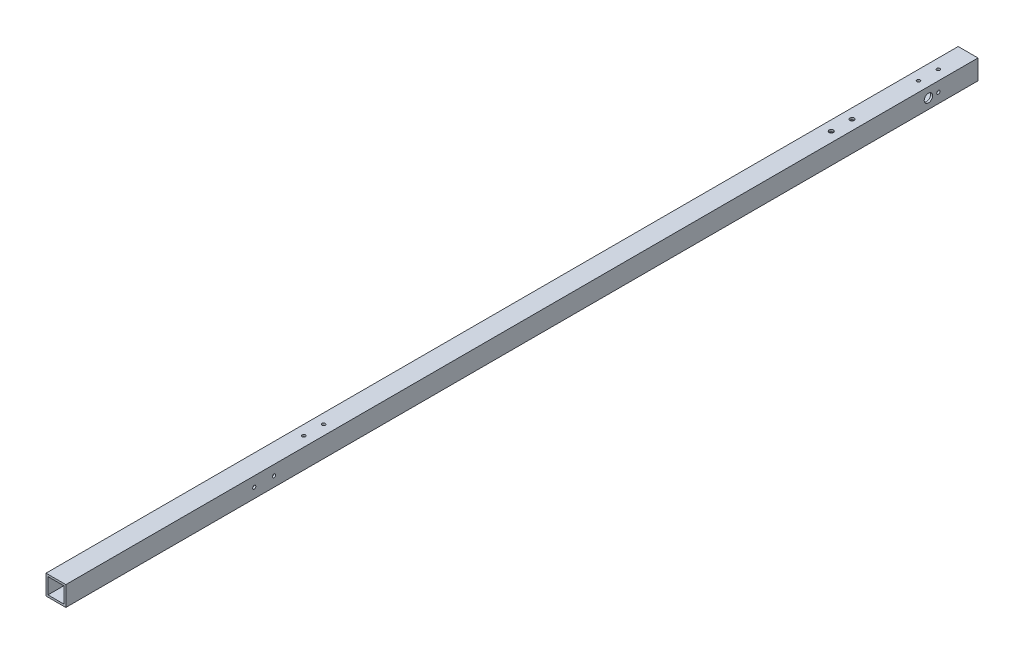
ISO-10303-21;
HEADER;
FILE_DESCRIPTION(('STEP AP214'),'2;1');
FILE_NAME('part.step','',(''),(''),'','','');
FILE_SCHEMA(('AUTOMOTIVE_DESIGN { 1 0 10303 214 1 1 1 1 }'));
ENDSEC;
DATA;
#1=APPLICATION_CONTEXT('core data for automotive mechanical design processes');
#2=APPLICATION_PROTOCOL_DEFINITION('international standard','automotive_design',2000,#1);
#3=PRODUCT_CONTEXT('',#1,'mechanical');
#4=PRODUCT('Part','Part','',(#3));
#5=PRODUCT_RELATED_PRODUCT_CATEGORY('part','',(#4));
#6=PRODUCT_DEFINITION_FORMATION('','',#4);
#7=PRODUCT_DEFINITION_CONTEXT('part definition',#1,'design');
#8=PRODUCT_DEFINITION('design','',#6,#7);
#9=PRODUCT_DEFINITION_SHAPE('','',#8);
#10=(LENGTH_UNIT() NAMED_UNIT(*) SI_UNIT(.MILLI.,.METRE.));
#11=(NAMED_UNIT(*) PLANE_ANGLE_UNIT() SI_UNIT($,.RADIAN.));
#12=(NAMED_UNIT(*) SI_UNIT($,.STERADIAN.) SOLID_ANGLE_UNIT());
#13=UNCERTAINTY_MEASURE_WITH_UNIT(LENGTH_MEASURE(1.E-05),#10,'distance_accuracy_value','');
#14=(GEOMETRIC_REPRESENTATION_CONTEXT(3) GLOBAL_UNCERTAINTY_ASSIGNED_CONTEXT((#13)) GLOBAL_UNIT_ASSIGNED_CONTEXT((#10,
#11,#12)) REPRESENTATION_CONTEXT('',''));
#15=CARTESIAN_POINT('',(0.,0.,0.));
#16=DIRECTION('',(0.,0.,1.));
#17=DIRECTION('',(1.,0.,0.));
#18=AXIS2_PLACEMENT_3D('',#15,#16,#17);
#19=CARTESIAN_POINT('',(10.,10.,970.));
#20=DIRECTION('',(-1.,0.,0.));
#21=DIRECTION('',(0.,0.,1.));
#22=AXIS2_PLACEMENT_3D('',#19,#20,#21);
#23=PLANE('',#22);
#24=CARTESIAN_POINT('',(10.,0.,39.9999999999999));
#25=DIRECTION('',(1.,0.,0.));
#26=DIRECTION('',(0.,0.,-1.));
#27=AXIS2_PLACEMENT_3D('',#24,#25,#26);
#28=CIRCLE('',#27,1.64999999999999);
#29=CARTESIAN_POINT('',(10.,0.,38.3499999999999));
#30=VERTEX_POINT('',#29);
#31=EDGE_CURVE('E245',#30,#30,#28,.T.);
#32=ORIENTED_EDGE('',*,*,#31,.F.);
#33=EDGE_LOOP('',(#32));
#34=FACE_BOUND('',#33,.T.);
#35=CARTESIAN_POINT('',(10.,0.,710.));
#36=DIRECTION('',(1.,0.,0.));
#37=DIRECTION('',(0.,0.,-1.));
#38=AXIS2_PLACEMENT_3D('',#35,#36,#37);
#39=CIRCLE('',#38,1.64999999999999);
#40=CARTESIAN_POINT('',(10.,0.,708.35));
#41=VERTEX_POINT('',#40);
#42=EDGE_CURVE('E249',#41,#41,#39,.T.);
#43=ORIENTED_EDGE('',*,*,#42,.F.);
#44=EDGE_LOOP('',(#43));
#45=FACE_BOUND('',#44,.T.);
#46=DIRECTION('',(0.,1.,0.));
#47=VECTOR('',#46,1.);
#48=CARTESIAN_POINT('',(10.,10.,920.));
#49=LINE('',#48,#47);
#50=CARTESIAN_POINT('',(10.,-10.,920.));
#51=VERTEX_POINT('',#50);
#52=CARTESIAN_POINT('',(10.,10.,920.));
#53=VERTEX_POINT('',#52);
#54=EDGE_CURVE('E186',#51,#53,#49,.T.);
#55=ORIENTED_EDGE('',*,*,#54,.F.);
#56=DIRECTION('',(0.,0.,-1.));
#57=VECTOR('',#56,1.);
#58=CARTESIAN_POINT('',(10.,-10.,970.));
#59=LINE('',#58,#57);
#60=CARTESIAN_POINT('',(10.,-10.,0.));
#61=VERTEX_POINT('',#60);
#62=EDGE_CURVE('E138',#51,#61,#59,.T.);
#63=ORIENTED_EDGE('',*,*,#62,.T.);
#64=DIRECTION('',(0.,1.,0.));
#65=VECTOR('',#64,1.);
#66=CARTESIAN_POINT('',(10.,10.,0.));
#67=LINE('',#66,#65);
#68=CARTESIAN_POINT('',(10.,10.,0.));
#69=VERTEX_POINT('',#68);
#70=EDGE_CURVE('E126',#61,#69,#67,.T.);
#71=ORIENTED_EDGE('',*,*,#70,.T.);
#72=DIRECTION('',(0.,0.,-1.));
#73=VECTOR('',#72,1.);
#74=CARTESIAN_POINT('',(10.,10.,970.));
#75=LINE('',#74,#73);
#76=EDGE_CURVE('E43',#53,#69,#75,.T.);
#77=ORIENTED_EDGE('',*,*,#76,.F.);
#78=EDGE_LOOP('',(#55,#63,#71,#77));
#79=FACE_BOUND('',#78,.T.);
#80=CARTESIAN_POINT('',(10.,0.,49.9999999999999));
#81=DIRECTION('',(1.,0.,0.));
#82=DIRECTION('',(0.,0.,-1.));
#83=AXIS2_PLACEMENT_3D('',#80,#81,#82);
#84=CIRCLE('',#83,4.25000000000001);
#85=CARTESIAN_POINT('',(10.,0.,45.7499999999999));
#86=VERTEX_POINT('',#85);
#87=EDGE_CURVE('E149',#86,#86,#84,.T.);
#88=ORIENTED_EDGE('',*,*,#87,.F.);
#89=EDGE_LOOP('',(#88));
#90=FACE_BOUND('',#89,.T.);
#91=CARTESIAN_POINT('',(10.,0.,730.));
#92=DIRECTION('',(1.,0.,0.));
#93=DIRECTION('',(0.,0.,-1.));
#94=AXIS2_PLACEMENT_3D('',#91,#92,#93);
#95=CIRCLE('',#94,1.64999999999999);
#96=CARTESIAN_POINT('',(10.,0.,728.35));
#97=VERTEX_POINT('',#96);
#98=EDGE_CURVE('E258',#97,#97,#95,.T.);
#99=ORIENTED_EDGE('',*,*,#98,.F.);
#100=EDGE_LOOP('',(#99));
#101=FACE_BOUND('',#100,.T.);
#102=ADVANCED_FACE('F35',(#34,#45,#79,#90,#101),#23,.F.);
#103=CARTESIAN_POINT('',(-10.,10.,970.));
#104=DIRECTION('',(0.,-1.,0.));
#105=DIRECTION('',(1.,0.,0.));
#106=AXIS2_PLACEMENT_3D('',#103,#104,#105);
#107=PLANE('',#106);
#108=CARTESIAN_POINT('',(0.,10.,650.));
#109=DIRECTION('',(0.,1.,0.));
#110=DIRECTION('',(0.,0.,1.));
#111=AXIS2_PLACEMENT_3D('',#108,#109,#110);
#112=CIRCLE('',#111,1.64999999999999);
#113=CARTESIAN_POINT('',(0.,10.,651.65));
#114=VERTEX_POINT('',#113);
#115=EDGE_CURVE('E164',#114,#114,#112,.T.);
#116=ORIENTED_EDGE('',*,*,#115,.F.);
#117=EDGE_LOOP('',(#116));
#118=FACE_BOUND('',#117,.T.);
#119=DIRECTION('',(-1.,0.,0.));
#120=VECTOR('',#119,1.);
#121=CARTESIAN_POINT('',(-10.,10.,920.));
#122=LINE('',#121,#120);
#123=CARTESIAN_POINT('',(-10.,10.,920.));
#124=VERTEX_POINT('',#123);
#125=EDGE_CURVE('E184',#53,#124,#122,.T.);
#126=ORIENTED_EDGE('',*,*,#125,.F.);
#127=ORIENTED_EDGE('',*,*,#76,.T.);
#128=DIRECTION('',(-1.,0.,0.));
#129=VECTOR('',#128,1.);
#130=CARTESIAN_POINT('',(-10.,10.,0.));
#131=LINE('',#130,#129);
#132=CARTESIAN_POINT('',(-10.,10.,0.));
#133=VERTEX_POINT('',#132);
#134=EDGE_CURVE('E129',#69,#133,#131,.T.);
#135=ORIENTED_EDGE('',*,*,#134,.T.);
#136=DIRECTION('',(0.,0.,-1.));
#137=VECTOR('',#136,1.);
#138=CARTESIAN_POINT('',(-10.,10.,970.));
#139=LINE('',#138,#137);
#140=EDGE_CURVE('E142',#124,#133,#139,.T.);
#141=ORIENTED_EDGE('',*,*,#140,.F.);
#142=EDGE_LOOP('',(#126,#127,#135,#141));
#143=FACE_BOUND('',#142,.T.);
#144=CARTESIAN_POINT('',(0.,10.,117.));
#145=DIRECTION('',(0.,1.,0.));
#146=DIRECTION('',(-1.,0.,0.));
#147=AXIS2_PLACEMENT_3D('',#144,#145,#146);
#148=CIRCLE('',#147,2.19999999999999);
#149=CARTESIAN_POINT('',(-2.19999999999999,10.,117.));
#150=VERTEX_POINT('',#149);
#151=EDGE_CURVE('E154',#150,#150,#148,.T.);
#152=ORIENTED_EDGE('',*,*,#151,.F.);
#153=EDGE_LOOP('',(#152));
#154=FACE_BOUND('',#153,.T.);
#155=CARTESIAN_POINT('',(0.,10.,138.));
#156=DIRECTION('',(0.,1.,0.));
#157=DIRECTION('',(-1.,0.,0.));
#158=AXIS2_PLACEMENT_3D('',#155,#156,#157);
#159=CIRCLE('',#158,2.20000000000001);
#160=CARTESIAN_POINT('',(-2.20000000000001,10.,138.));
#161=VERTEX_POINT('',#160);
#162=EDGE_CURVE('E188',#161,#161,#159,.T.);
#163=ORIENTED_EDGE('',*,*,#162,.F.);
#164=EDGE_LOOP('',(#163));
#165=FACE_BOUND('',#164,.T.);
#166=CARTESIAN_POINT('',(0.,10.,670.));
#167=DIRECTION('',(0.,1.,0.));
#168=DIRECTION('',(0.,0.,1.));
#169=AXIS2_PLACEMENT_3D('',#166,#167,#168);
#170=CIRCLE('',#169,1.64999999999999);
#171=CARTESIAN_POINT('',(0.,10.,671.65));
#172=VERTEX_POINT('',#171);
#173=EDGE_CURVE('E161',#172,#172,#170,.T.);
#174=ORIENTED_EDGE('',*,*,#173,.F.);
#175=EDGE_LOOP('',(#174));
#176=FACE_BOUND('',#175,.T.);
#177=CARTESIAN_POINT('',(0.,10.,50.));
#178=DIRECTION('',(0.,1.,0.));
#179=DIRECTION('',(0.,0.,1.));
#180=AXIS2_PLACEMENT_3D('',#177,#178,#179);
#181=CIRCLE('',#180,1.64999999999999);
#182=CARTESIAN_POINT('',(0.,10.,51.65));
#183=VERTEX_POINT('',#182);
#184=EDGE_CURVE('E175',#183,#183,#181,.T.);
#185=ORIENTED_EDGE('',*,*,#184,.F.);
#186=EDGE_LOOP('',(#185));
#187=FACE_BOUND('',#186,.T.);
#188=CARTESIAN_POINT('',(0.,10.,30.));
#189=DIRECTION('',(0.,1.,0.));
#190=DIRECTION('',(0.,0.,1.));
#191=AXIS2_PLACEMENT_3D('',#188,#189,#190);
#192=CIRCLE('',#191,1.64999999999999);
#193=CARTESIAN_POINT('',(0.,10.,31.65));
#194=VERTEX_POINT('',#193);
#195=EDGE_CURVE('E272',#194,#194,#192,.T.);
#196=ORIENTED_EDGE('',*,*,#195,.F.);
#197=EDGE_LOOP('',(#196));
#198=FACE_BOUND('',#197,.T.);
#199=ADVANCED_FACE('F236',(#118,#143,#154,#165,#176,#187,#198),#107,.F.);
#200=CARTESIAN_POINT('',(-10.,10.,970.));
#201=DIRECTION('',(1.,0.,0.));
#202=DIRECTION('',(0.,0.,-1.));
#203=AXIS2_PLACEMENT_3D('',#200,#201,#202);
#204=PLANE('',#203);
#205=CARTESIAN_POINT('',(-10.,0.,49.9999999999999));
#206=DIRECTION('',(1.,0.,0.));
#207=DIRECTION('',(0.,0.,-1.));
#208=AXIS2_PLACEMENT_3D('',#205,#206,#207);
#209=CIRCLE('',#208,4.25000000000001);
#210=CARTESIAN_POINT('',(-10.,0.,45.7499999999999));
#211=VERTEX_POINT('',#210);
#212=EDGE_CURVE('E264',#211,#211,#209,.T.);
#213=ORIENTED_EDGE('',*,*,#212,.T.);
#214=EDGE_LOOP('',(#213));
#215=FACE_BOUND('',#214,.T.);
#216=DIRECTION('',(0.,-1.,0.));
#217=VECTOR('',#216,1.);
#218=CARTESIAN_POINT('',(-10.,10.,920.));
#219=LINE('',#218,#217);
#220=CARTESIAN_POINT('',(-10.,-10.,920.));
#221=VERTEX_POINT('',#220);
#222=EDGE_CURVE('E51',#124,#221,#219,.T.);
#223=ORIENTED_EDGE('',*,*,#222,.F.);
#224=ORIENTED_EDGE('',*,*,#140,.T.);
#225=DIRECTION('',(0.,-1.,0.));
#226=VECTOR('',#225,1.);
#227=CARTESIAN_POINT('',(-10.,10.,0.));
#228=LINE('',#227,#226);
#229=CARTESIAN_POINT('',(-10.,-10.,0.));
#230=VERTEX_POINT('',#229);
#231=EDGE_CURVE('E132',#133,#230,#228,.T.);
#232=ORIENTED_EDGE('',*,*,#231,.T.);
#233=DIRECTION('',(0.,0.,-1.));
#234=VECTOR('',#233,1.);
#235=CARTESIAN_POINT('',(-10.,-10.,970.));
#236=LINE('',#235,#234);
#237=EDGE_CURVE('E140',#221,#230,#236,.T.);
#238=ORIENTED_EDGE('',*,*,#237,.F.);
#239=EDGE_LOOP('',(#223,#224,#232,#238));
#240=FACE_BOUND('',#239,.T.);
#241=ADVANCED_FACE('F229',(#215,#240),#204,.F.);
#242=CARTESIAN_POINT('',(-10.,-10.,970.));
#243=DIRECTION('',(0.,1.,0.));
#244=DIRECTION('',(0.,0.,1.));
#245=AXIS2_PLACEMENT_3D('',#242,#243,#244);
#246=PLANE('',#245);
#247=CARTESIAN_POINT('',(0.,-10.,138.));
#248=DIRECTION('',(0.,1.,0.));
#249=DIRECTION('',(0.,0.,1.));
#250=AXIS2_PLACEMENT_3D('',#247,#248,#249);
#251=CIRCLE('',#250,2.20000000000001);
#252=CARTESIAN_POINT('',(0.,-10.,140.2));
#253=VERTEX_POINT('',#252);
#254=EDGE_CURVE('E158',#253,#253,#251,.T.);
#255=ORIENTED_EDGE('',*,*,#254,.T.);
#256=EDGE_LOOP('',(#255));
#257=FACE_BOUND('',#256,.T.);
#258=CARTESIAN_POINT('',(0.,-10.,117.));
#259=DIRECTION('',(0.,1.,0.));
#260=DIRECTION('',(0.,0.,1.));
#261=AXIS2_PLACEMENT_3D('',#258,#259,#260);
#262=CIRCLE('',#261,2.19999999999999);
#263=CARTESIAN_POINT('',(0.,-10.,119.2));
#264=VERTEX_POINT('',#263);
#265=EDGE_CURVE('E199',#264,#264,#262,.T.);
#266=ORIENTED_EDGE('',*,*,#265,.T.);
#267=EDGE_LOOP('',(#266));
#268=FACE_BOUND('',#267,.T.);
#269=DIRECTION('',(1.,0.,0.));
#270=VECTOR('',#269,1.);
#271=CARTESIAN_POINT('',(-10.,-10.,920.));
#272=LINE('',#271,#270);
#273=EDGE_CURVE('E181',#221,#51,#272,.T.);
#274=ORIENTED_EDGE('',*,*,#273,.F.);
#275=ORIENTED_EDGE('',*,*,#237,.T.);
#276=DIRECTION('',(1.,0.,0.));
#277=VECTOR('',#276,1.);
#278=CARTESIAN_POINT('',(-10.,-10.,0.));
#279=LINE('',#278,#277);
#280=EDGE_CURVE('E135',#230,#61,#279,.T.);
#281=ORIENTED_EDGE('',*,*,#280,.T.);
#282=ORIENTED_EDGE('',*,*,#62,.F.);
#283=EDGE_LOOP('',(#274,#275,#281,#282));
#284=FACE_BOUND('',#283,.T.);
#285=ADVANCED_FACE('F220',(#257,#268,#284),#246,.F.);
#286=CARTESIAN_POINT('',(8.,8.,970.));
#287=DIRECTION('',(-1.,0.,0.));
#288=DIRECTION('',(0.,-1.,0.));
#289=AXIS2_PLACEMENT_3D('',#286,#287,#288);
#290=PLANE('',#289);
#291=CARTESIAN_POINT('',(8.,0.,39.9999999999999));
#292=DIRECTION('',(-1.,0.,0.));
#293=DIRECTION('',(0.,-1.,0.));
#294=AXIS2_PLACEMENT_3D('',#291,#292,#293);
#295=CIRCLE('',#294,1.64999999999999);
#296=CARTESIAN_POINT('',(8.,-1.64999999999999,39.9999999999999));
#297=VERTEX_POINT('',#296);
#298=EDGE_CURVE('E512',#297,#297,#295,.T.);
#299=ORIENTED_EDGE('',*,*,#298,.F.);
#300=EDGE_LOOP('',(#299));
#301=FACE_BOUND('',#300,.T.);
#302=CARTESIAN_POINT('',(8.,0.,710.));
#303=DIRECTION('',(-1.,0.,0.));
#304=DIRECTION('',(0.,-1.,0.));
#305=AXIS2_PLACEMENT_3D('',#302,#303,#304);
#306=CIRCLE('',#305,1.64999999999999);
#307=CARTESIAN_POINT('',(8.,-1.64999999999999,710.));
#308=VERTEX_POINT('',#307);
#309=EDGE_CURVE('E261',#308,#308,#306,.T.);
#310=ORIENTED_EDGE('',*,*,#309,.F.);
#311=EDGE_LOOP('',(#310));
#312=FACE_BOUND('',#311,.T.);
#313=CARTESIAN_POINT('',(8.,0.,730.));
#314=DIRECTION('',(-1.,0.,0.));
#315=DIRECTION('',(0.,-1.,0.));
#316=AXIS2_PLACEMENT_3D('',#313,#314,#315);
#317=CIRCLE('',#316,1.64999999999999);
#318=CARTESIAN_POINT('',(8.,-1.64999999999999,730.));
#319=VERTEX_POINT('',#318);
#320=EDGE_CURVE('E260',#319,#319,#317,.T.);
#321=ORIENTED_EDGE('',*,*,#320,.F.);
#322=EDGE_LOOP('',(#321));
#323=FACE_BOUND('',#322,.T.);
#324=CARTESIAN_POINT('',(8.,0.,49.9999999999999));
#325=DIRECTION('',(-1.,0.,0.));
#326=DIRECTION('',(0.,-1.,0.));
#327=AXIS2_PLACEMENT_3D('',#324,#325,#326);
#328=CIRCLE('',#327,4.25000000000001);
#329=CARTESIAN_POINT('',(8.,-4.25000000000001,49.9999999999999));
#330=VERTEX_POINT('',#329);
#331=EDGE_CURVE('E145',#330,#330,#328,.T.);
#332=ORIENTED_EDGE('',*,*,#331,.F.);
#333=EDGE_LOOP('',(#332));
#334=FACE_BOUND('',#333,.T.);
#335=DIRECTION('',(0.,0.,-1.));
#336=VECTOR('',#335,1.);
#337=CARTESIAN_POINT('',(8.,-8.,970.));
#338=LINE('',#337,#336);
#339=CARTESIAN_POINT('',(8.,-8.,920.));
#340=VERTEX_POINT('',#339);
#341=CARTESIAN_POINT('',(8.,-8.,0.));
#342=VERTEX_POINT('',#341);
#343=EDGE_CURVE('E118',#340,#342,#338,.T.);
#344=ORIENTED_EDGE('',*,*,#343,.F.);
#345=DIRECTION('',(0.,1.,0.));
#346=VECTOR('',#345,1.);
#347=CARTESIAN_POINT('',(8.,8.,920.));
#348=LINE('',#347,#346);
#349=CARTESIAN_POINT('',(8.,8.,920.));
#350=VERTEX_POINT('',#349);
#351=EDGE_CURVE('E59',#340,#350,#348,.T.);
#352=ORIENTED_EDGE('',*,*,#351,.T.);
#353=DIRECTION('',(0.,0.,-1.));
#354=VECTOR('',#353,1.);
#355=CARTESIAN_POINT('',(8.,8.,970.));
#356=LINE('',#355,#354);
#357=CARTESIAN_POINT('',(8.,8.,0.));
#358=VERTEX_POINT('',#357);
#359=EDGE_CURVE('E120',#350,#358,#356,.T.);
#360=ORIENTED_EDGE('',*,*,#359,.T.);
#361=DIRECTION('',(0.,1.,0.));
#362=VECTOR('',#361,1.);
#363=CARTESIAN_POINT('',(8.,8.,0.));
#364=LINE('',#363,#362);
#365=EDGE_CURVE('E148',#342,#358,#364,.T.);
#366=ORIENTED_EDGE('',*,*,#365,.F.);
#367=EDGE_LOOP('',(#344,#352,#360,#366));
#368=FACE_BOUND('',#367,.T.);
#369=ADVANCED_FACE('F218',(#301,#312,#323,#334,#368),#290,.T.);
#370=CARTESIAN_POINT('',(-8.,8.,970.));
#371=DIRECTION('',(0.,-1.,0.));
#372=DIRECTION('',(0.,0.,-1.));
#373=AXIS2_PLACEMENT_3D('',#370,#371,#372);
#374=PLANE('',#373);
#375=CARTESIAN_POINT('',(0.,8.,30.));
#376=DIRECTION('',(0.,-1.,0.));
#377=DIRECTION('',(0.,0.,-1.));
#378=AXIS2_PLACEMENT_3D('',#375,#376,#377);
#379=CIRCLE('',#378,1.64999999999999);
#380=CARTESIAN_POINT('',(0.,8.,28.35));
#381=VERTEX_POINT('',#380);
#382=EDGE_CURVE('E275',#381,#381,#379,.T.);
#383=ORIENTED_EDGE('',*,*,#382,.F.);
#384=EDGE_LOOP('',(#383));
#385=FACE_BOUND('',#384,.T.);
#386=CARTESIAN_POINT('',(0.,8.,50.));
#387=DIRECTION('',(0.,-1.,0.));
#388=DIRECTION('',(0.,0.,-1.));
#389=AXIS2_PLACEMENT_3D('',#386,#387,#388);
#390=CIRCLE('',#389,1.64999999999999);
#391=CARTESIAN_POINT('',(0.,8.,48.35));
#392=VERTEX_POINT('',#391);
#393=EDGE_CURVE('E170',#392,#392,#390,.T.);
#394=ORIENTED_EDGE('',*,*,#393,.F.);
#395=EDGE_LOOP('',(#394));
#396=FACE_BOUND('',#395,.T.);
#397=CARTESIAN_POINT('',(0.,8.,650.));
#398=DIRECTION('',(0.,-1.,0.));
#399=DIRECTION('',(0.,0.,-1.));
#400=AXIS2_PLACEMENT_3D('',#397,#398,#399);
#401=CIRCLE('',#400,1.64999999999999);
#402=CARTESIAN_POINT('',(0.,8.,648.35));
#403=VERTEX_POINT('',#402);
#404=EDGE_CURVE('E162',#403,#403,#401,.T.);
#405=ORIENTED_EDGE('',*,*,#404,.F.);
#406=EDGE_LOOP('',(#405));
#407=FACE_BOUND('',#406,.T.);
#408=CARTESIAN_POINT('',(0.,8.,670.));
#409=DIRECTION('',(0.,-1.,0.));
#410=DIRECTION('',(0.,0.,-1.));
#411=AXIS2_PLACEMENT_3D('',#408,#409,#410);
#412=CIRCLE('',#411,1.64999999999999);
#413=CARTESIAN_POINT('',(0.,8.,668.35));
#414=VERTEX_POINT('',#413);
#415=EDGE_CURVE('E112',#414,#414,#412,.T.);
#416=ORIENTED_EDGE('',*,*,#415,.F.);
#417=EDGE_LOOP('',(#416));
#418=FACE_BOUND('',#417,.T.);
#419=CARTESIAN_POINT('',(0.,8.,117.));
#420=DIRECTION('',(0.,-1.,0.));
#421=DIRECTION('',(0.,0.,-1.));
#422=AXIS2_PLACEMENT_3D('',#419,#420,#421);
#423=CIRCLE('',#422,2.19999999999999);
#424=CARTESIAN_POINT('',(0.,8.,114.8));
#425=VERTEX_POINT('',#424);
#426=EDGE_CURVE('E157',#425,#425,#423,.T.);
#427=ORIENTED_EDGE('',*,*,#426,.F.);
#428=EDGE_LOOP('',(#427));
#429=FACE_BOUND('',#428,.T.);
#430=CARTESIAN_POINT('',(0.,8.,138.));
#431=DIRECTION('',(0.,-1.,0.));
#432=DIRECTION('',(0.,0.,-1.));
#433=AXIS2_PLACEMENT_3D('',#430,#431,#432);
#434=CIRCLE('',#433,2.20000000000001);
#435=CARTESIAN_POINT('',(0.,8.,135.8));
#436=VERTEX_POINT('',#435);
#437=EDGE_CURVE('E153',#436,#436,#434,.T.);
#438=ORIENTED_EDGE('',*,*,#437,.F.);
#439=EDGE_LOOP('',(#438));
#440=FACE_BOUND('',#439,.T.);
#441=ORIENTED_EDGE('',*,*,#359,.F.);
#442=DIRECTION('',(-1.,0.,0.));
#443=VECTOR('',#442,1.);
#444=CARTESIAN_POINT('',(-8.,8.,920.));
#445=LINE('',#444,#443);
#446=CARTESIAN_POINT('',(-8.,8.,920.));
#447=VERTEX_POINT('',#446);
#448=EDGE_CURVE('E111',#350,#447,#445,.T.);
#449=ORIENTED_EDGE('',*,*,#448,.T.);
#450=DIRECTION('',(0.,0.,-1.));
#451=VECTOR('',#450,1.);
#452=CARTESIAN_POINT('',(-8.,8.,970.));
#453=LINE('',#452,#451);
#454=CARTESIAN_POINT('',(-8.,8.,0.));
#455=VERTEX_POINT('',#454);
#456=EDGE_CURVE('E110',#447,#455,#453,.T.);
#457=ORIENTED_EDGE('',*,*,#456,.T.);
#458=DIRECTION('',(-1.,0.,0.));
#459=VECTOR('',#458,1.);
#460=CARTESIAN_POINT('',(-8.,8.,0.));
#461=LINE('',#460,#459);
#462=EDGE_CURVE('E206',#358,#455,#461,.T.);
#463=ORIENTED_EDGE('',*,*,#462,.F.);
#464=EDGE_LOOP('',(#441,#449,#457,#463));
#465=FACE_BOUND('',#464,.T.);
#466=ADVANCED_FACE('F216',(#385,#396,#407,#418,#429,#440,#465),#374,.T.);
#467=CARTESIAN_POINT('',(-8.,8.,970.));
#468=DIRECTION('',(1.,0.,0.));
#469=DIRECTION('',(0.,0.,-1.));
#470=AXIS2_PLACEMENT_3D('',#467,#468,#469);
#471=PLANE('',#470);
#472=CARTESIAN_POINT('',(-8.,0.,49.9999999999999));
#473=DIRECTION('',(1.,0.,0.));
#474=DIRECTION('',(0.,0.,-1.));
#475=AXIS2_PLACEMENT_3D('',#472,#473,#474);
#476=CIRCLE('',#475,4.25000000000001);
#477=CARTESIAN_POINT('',(-8.,0.,45.7499999999999));
#478=VERTEX_POINT('',#477);
#479=EDGE_CURVE('E38',#478,#478,#476,.T.);
#480=ORIENTED_EDGE('',*,*,#479,.F.);
#481=EDGE_LOOP('',(#480));
#482=FACE_BOUND('',#481,.T.);
#483=ORIENTED_EDGE('',*,*,#456,.F.);
#484=DIRECTION('',(0.,-1.,0.));
#485=VECTOR('',#484,1.);
#486=CARTESIAN_POINT('',(-8.,8.,920.));
#487=LINE('',#486,#485);
#488=CARTESIAN_POINT('',(-8.,-8.,920.));
#489=VERTEX_POINT('',#488);
#490=EDGE_CURVE('E99',#447,#489,#487,.T.);
#491=ORIENTED_EDGE('',*,*,#490,.T.);
#492=DIRECTION('',(0.,0.,-1.));
#493=VECTOR('',#492,1.);
#494=CARTESIAN_POINT('',(-8.,-8.,970.));
#495=LINE('',#494,#493);
#496=CARTESIAN_POINT('',(-8.,-8.,0.));
#497=VERTEX_POINT('',#496);
#498=EDGE_CURVE('E108',#489,#497,#495,.T.);
#499=ORIENTED_EDGE('',*,*,#498,.T.);
#500=DIRECTION('',(0.,-1.,0.));
#501=VECTOR('',#500,1.);
#502=CARTESIAN_POINT('',(-8.,8.,0.));
#503=LINE('',#502,#501);
#504=EDGE_CURVE('E209',#455,#497,#503,.T.);
#505=ORIENTED_EDGE('',*,*,#504,.F.);
#506=EDGE_LOOP('',(#483,#491,#499,#505));
#507=FACE_BOUND('',#506,.T.);
#508=ADVANCED_FACE('F106',(#482,#507),#471,.T.);
#509=CARTESIAN_POINT('',(-8.,-8.,970.));
#510=DIRECTION('',(0.,1.,0.));
#511=DIRECTION('',(0.,0.,1.));
#512=AXIS2_PLACEMENT_3D('',#509,#510,#511);
#513=PLANE('',#512);
#514=CARTESIAN_POINT('',(0.,-8.,117.));
#515=DIRECTION('',(0.,1.,0.));
#516=DIRECTION('',(0.,0.,1.));
#517=AXIS2_PLACEMENT_3D('',#514,#515,#516);
#518=CIRCLE('',#517,2.19999999999999);
#519=CARTESIAN_POINT('',(0.,-8.,119.2));
#520=VERTEX_POINT('',#519);
#521=EDGE_CURVE('E155',#520,#520,#518,.T.);
#522=ORIENTED_EDGE('',*,*,#521,.F.);
#523=EDGE_LOOP('',(#522));
#524=FACE_BOUND('',#523,.T.);
#525=CARTESIAN_POINT('',(0.,-8.,138.));
#526=DIRECTION('',(0.,1.,0.));
#527=DIRECTION('',(0.,0.,1.));
#528=AXIS2_PLACEMENT_3D('',#525,#526,#527);
#529=CIRCLE('',#528,2.20000000000001);
#530=CARTESIAN_POINT('',(0.,-8.,140.2));
#531=VERTEX_POINT('',#530);
#532=EDGE_CURVE('E150',#531,#531,#529,.T.);
#533=ORIENTED_EDGE('',*,*,#532,.F.);
#534=EDGE_LOOP('',(#533));
#535=FACE_BOUND('',#534,.T.);
#536=ORIENTED_EDGE('',*,*,#498,.F.);
#537=DIRECTION('',(1.,0.,0.));
#538=VECTOR('',#537,1.);
#539=CARTESIAN_POINT('',(-8.,-8.,920.));
#540=LINE('',#539,#538);
#541=EDGE_CURVE('E11',#489,#340,#540,.T.);
#542=ORIENTED_EDGE('',*,*,#541,.T.);
#543=ORIENTED_EDGE('',*,*,#343,.T.);
#544=DIRECTION('',(1.,0.,0.));
#545=VECTOR('',#544,1.);
#546=CARTESIAN_POINT('',(-8.,-8.,0.));
#547=LINE('',#546,#545);
#548=EDGE_CURVE('E116',#497,#342,#547,.T.);
#549=ORIENTED_EDGE('',*,*,#548,.F.);
#550=EDGE_LOOP('',(#536,#542,#543,#549));
#551=FACE_BOUND('',#550,.T.);
#552=ADVANCED_FACE('F114',(#524,#535,#551),#513,.T.);
#553=CARTESIAN_POINT('',(0.,0.,0.));
#554=DIRECTION('',(0.,0.,1.));
#555=DIRECTION('',(1.,0.,0.));
#556=AXIS2_PLACEMENT_3D('',#553,#554,#555);
#557=PLANE('',#556);
#558=ORIENTED_EDGE('',*,*,#70,.F.);
#559=ORIENTED_EDGE('',*,*,#280,.F.);
#560=ORIENTED_EDGE('',*,*,#231,.F.);
#561=ORIENTED_EDGE('',*,*,#134,.F.);
#562=EDGE_LOOP('',(#558,#559,#560,#561));
#563=FACE_BOUND('',#562,.T.);
#564=ORIENTED_EDGE('',*,*,#365,.T.);
#565=ORIENTED_EDGE('',*,*,#462,.T.);
#566=ORIENTED_EDGE('',*,*,#504,.T.);
#567=ORIENTED_EDGE('',*,*,#548,.T.);
#568=EDGE_LOOP('',(#564,#565,#566,#567));
#569=FACE_BOUND('',#568,.T.);
#570=ADVANCED_FACE('F211',(#563,#569),#557,.F.);
#571=CARTESIAN_POINT('',(0.,0.,49.9999999999999));
#572=DIRECTION('',(1.,0.,0.));
#573=DIRECTION('',(0.,0.,-1.));
#574=AXIS2_PLACEMENT_3D('',#571,#572,#573);
#575=CYLINDRICAL_SURFACE('',#574,4.25000000000001);
#576=ORIENTED_EDGE('',*,*,#331,.T.);
#577=EDGE_LOOP('',(#576));
#578=FACE_BOUND('',#577,.T.);
#579=ORIENTED_EDGE('',*,*,#87,.T.);
#580=EDGE_LOOP('',(#579));
#581=FACE_BOUND('',#580,.T.);
#582=ADVANCED_FACE('F319',(#578,#581),#575,.F.);
#583=CARTESIAN_POINT('',(0.,-20.,138.));
#584=DIRECTION('',(0.,1.,0.));
#585=DIRECTION('',(-1.,0.,0.));
#586=AXIS2_PLACEMENT_3D('',#583,#584,#585);
#587=CYLINDRICAL_SURFACE('',#586,2.20000000000001);
#588=ORIENTED_EDGE('',*,*,#532,.T.);
#589=EDGE_LOOP('',(#588));
#590=FACE_BOUND('',#589,.T.);
#591=ORIENTED_EDGE('',*,*,#254,.F.);
#592=EDGE_LOOP('',(#591));
#593=FACE_BOUND('',#592,.T.);
#594=ADVANCED_FACE('F315',(#590,#593),#587,.F.);
#595=CARTESIAN_POINT('',(0.,-20.,117.));
#596=DIRECTION('',(0.,1.,0.));
#597=DIRECTION('',(-1.,0.,0.));
#598=AXIS2_PLACEMENT_3D('',#595,#596,#597);
#599=CYLINDRICAL_SURFACE('',#598,2.19999999999999);
#600=ORIENTED_EDGE('',*,*,#521,.T.);
#601=EDGE_LOOP('',(#600));
#602=FACE_BOUND('',#601,.T.);
#603=ORIENTED_EDGE('',*,*,#265,.F.);
#604=EDGE_LOOP('',(#603));
#605=FACE_BOUND('',#604,.T.);
#606=ADVANCED_FACE('F311',(#602,#605),#599,.F.);
#607=ORIENTED_EDGE('',*,*,#437,.T.);
#608=EDGE_LOOP('',(#607));
#609=FACE_BOUND('',#608,.T.);
#610=ORIENTED_EDGE('',*,*,#162,.T.);
#611=EDGE_LOOP('',(#610));
#612=FACE_BOUND('',#611,.T.);
#613=ADVANCED_FACE('F314',(#609,#612),#587,.F.);
#614=ORIENTED_EDGE('',*,*,#426,.T.);
#615=EDGE_LOOP('',(#614));
#616=FACE_BOUND('',#615,.T.);
#617=ORIENTED_EDGE('',*,*,#151,.T.);
#618=EDGE_LOOP('',(#617));
#619=FACE_BOUND('',#618,.T.);
#620=ADVANCED_FACE('F310',(#616,#619),#599,.F.);
#621=CARTESIAN_POINT('',(0.,0.,920.));
#622=DIRECTION('',(0.,0.,1.));
#623=DIRECTION('',(1.,0.,0.));
#624=AXIS2_PLACEMENT_3D('',#621,#622,#623);
#625=PLANE('',#624);
#626=ORIENTED_EDGE('',*,*,#541,.F.);
#627=ORIENTED_EDGE('',*,*,#490,.F.);
#628=ORIENTED_EDGE('',*,*,#448,.F.);
#629=ORIENTED_EDGE('',*,*,#351,.F.);
#630=EDGE_LOOP('',(#626,#627,#628,#629));
#631=FACE_BOUND('',#630,.T.);
#632=ORIENTED_EDGE('',*,*,#54,.T.);
#633=ORIENTED_EDGE('',*,*,#125,.T.);
#634=ORIENTED_EDGE('',*,*,#222,.T.);
#635=ORIENTED_EDGE('',*,*,#273,.T.);
#636=EDGE_LOOP('',(#632,#633,#634,#635));
#637=FACE_BOUND('',#636,.T.);
#638=ADVANCED_FACE('F98',(#631,#637),#625,.T.);
#639=CARTESIAN_POINT('',(0.,10.,670.));
#640=DIRECTION('',(0.,1.,0.));
#641=DIRECTION('',(0.,0.,1.));
#642=AXIS2_PLACEMENT_3D('',#639,#640,#641);
#643=CYLINDRICAL_SURFACE('',#642,1.64999999999999);
#644=ORIENTED_EDGE('',*,*,#415,.T.);
#645=EDGE_LOOP('',(#644));
#646=FACE_BOUND('',#645,.T.);
#647=ORIENTED_EDGE('',*,*,#173,.T.);
#648=EDGE_LOOP('',(#647));
#649=FACE_BOUND('',#648,.T.);
#650=ADVANCED_FACE('F304',(#646,#649),#643,.F.);
#651=CARTESIAN_POINT('',(0.,10.,650.));
#652=DIRECTION('',(0.,1.,0.));
#653=DIRECTION('',(0.,0.,1.));
#654=AXIS2_PLACEMENT_3D('',#651,#652,#653);
#655=CYLINDRICAL_SURFACE('',#654,1.64999999999999);
#656=ORIENTED_EDGE('',*,*,#404,.T.);
#657=EDGE_LOOP('',(#656));
#658=FACE_BOUND('',#657,.T.);
#659=ORIENTED_EDGE('',*,*,#115,.T.);
#660=EDGE_LOOP('',(#659));
#661=FACE_BOUND('',#660,.T.);
#662=ADVANCED_FACE('F297',(#658,#661),#655,.F.);
#663=CARTESIAN_POINT('',(0.,10.,50.));
#664=DIRECTION('',(0.,1.,0.));
#665=DIRECTION('',(0.,0.,1.));
#666=AXIS2_PLACEMENT_3D('',#663,#664,#665);
#667=CYLINDRICAL_SURFACE('',#666,1.64999999999999);
#668=ORIENTED_EDGE('',*,*,#393,.T.);
#669=EDGE_LOOP('',(#668));
#670=FACE_BOUND('',#669,.T.);
#671=ORIENTED_EDGE('',*,*,#184,.T.);
#672=EDGE_LOOP('',(#671));
#673=FACE_BOUND('',#672,.T.);
#674=ADVANCED_FACE('F280',(#670,#673),#667,.F.);
#675=CARTESIAN_POINT('',(0.,10.,30.));
#676=DIRECTION('',(0.,1.,0.));
#677=DIRECTION('',(0.,0.,1.));
#678=AXIS2_PLACEMENT_3D('',#675,#676,#677);
#679=CYLINDRICAL_SURFACE('',#678,1.64999999999999);
#680=ORIENTED_EDGE('',*,*,#382,.T.);
#681=EDGE_LOOP('',(#680));
#682=FACE_BOUND('',#681,.T.);
#683=ORIENTED_EDGE('',*,*,#195,.T.);
#684=EDGE_LOOP('',(#683));
#685=FACE_BOUND('',#684,.T.);
#686=ADVANCED_FACE('F285',(#682,#685),#679,.F.);
#687=CARTESIAN_POINT('',(-10.,0.,49.9999999999999));
#688=DIRECTION('',(1.,0.,0.));
#689=DIRECTION('',(0.,0.,-1.));
#690=AXIS2_PLACEMENT_3D('',#687,#688,#689);
#691=CYLINDRICAL_SURFACE('',#690,4.25000000000001);
#692=ORIENTED_EDGE('',*,*,#479,.T.);
#693=EDGE_LOOP('',(#692));
#694=FACE_BOUND('',#693,.T.);
#695=ORIENTED_EDGE('',*,*,#212,.F.);
#696=EDGE_LOOP('',(#695));
#697=FACE_BOUND('',#696,.T.);
#698=ADVANCED_FACE('F287',(#694,#697),#691,.F.);
#699=CARTESIAN_POINT('',(10.,0.,730.));
#700=DIRECTION('',(1.,0.,0.));
#701=DIRECTION('',(0.,0.,-1.));
#702=AXIS2_PLACEMENT_3D('',#699,#700,#701);
#703=CYLINDRICAL_SURFACE('',#702,1.64999999999999);
#704=ORIENTED_EDGE('',*,*,#320,.T.);
#705=EDGE_LOOP('',(#704));
#706=FACE_BOUND('',#705,.T.);
#707=ORIENTED_EDGE('',*,*,#98,.T.);
#708=EDGE_LOOP('',(#707));
#709=FACE_BOUND('',#708,.T.);
#710=ADVANCED_FACE('F294',(#706,#709),#703,.F.);
#711=CARTESIAN_POINT('',(10.,0.,710.));
#712=DIRECTION('',(1.,0.,0.));
#713=DIRECTION('',(0.,0.,-1.));
#714=AXIS2_PLACEMENT_3D('',#711,#712,#713);
#715=CYLINDRICAL_SURFACE('',#714,1.64999999999999);
#716=ORIENTED_EDGE('',*,*,#309,.T.);
#717=EDGE_LOOP('',(#716));
#718=FACE_BOUND('',#717,.T.);
#719=ORIENTED_EDGE('',*,*,#42,.T.);
#720=EDGE_LOOP('',(#719));
#721=FACE_BOUND('',#720,.T.);
#722=ADVANCED_FACE('F412',(#718,#721),#715,.F.);
#723=CARTESIAN_POINT('',(10.,0.,39.9999999999999));
#724=DIRECTION('',(1.,0.,0.));
#725=DIRECTION('',(0.,0.,-1.));
#726=AXIS2_PLACEMENT_3D('',#723,#724,#725);
#727=CYLINDRICAL_SURFACE('',#726,1.64999999999999);
#728=ORIENTED_EDGE('',*,*,#298,.T.);
#729=EDGE_LOOP('',(#728));
#730=FACE_BOUND('',#729,.T.);
#731=ORIENTED_EDGE('',*,*,#31,.T.);
#732=EDGE_LOOP('',(#731));
#733=FACE_BOUND('',#732,.T.);
#734=ADVANCED_FACE('F421',(#730,#733),#727,.F.);
#735=CLOSED_SHELL('',(#102,#199,#241,#285,#369,#466,#508,#552,#570,#582,#594,#606,#613,#620,
#638,#650,#662,#674,#686,#698,#710,#722,#734));
#736=MANIFOLD_SOLID_BREP('B2',#735);
#737=ADVANCED_BREP_SHAPE_REPRESENTATION('',(#18,#736),#14);
#738=SHAPE_DEFINITION_REPRESENTATION(#9,#737);
ENDSEC;
END-ISO-10303-21;
